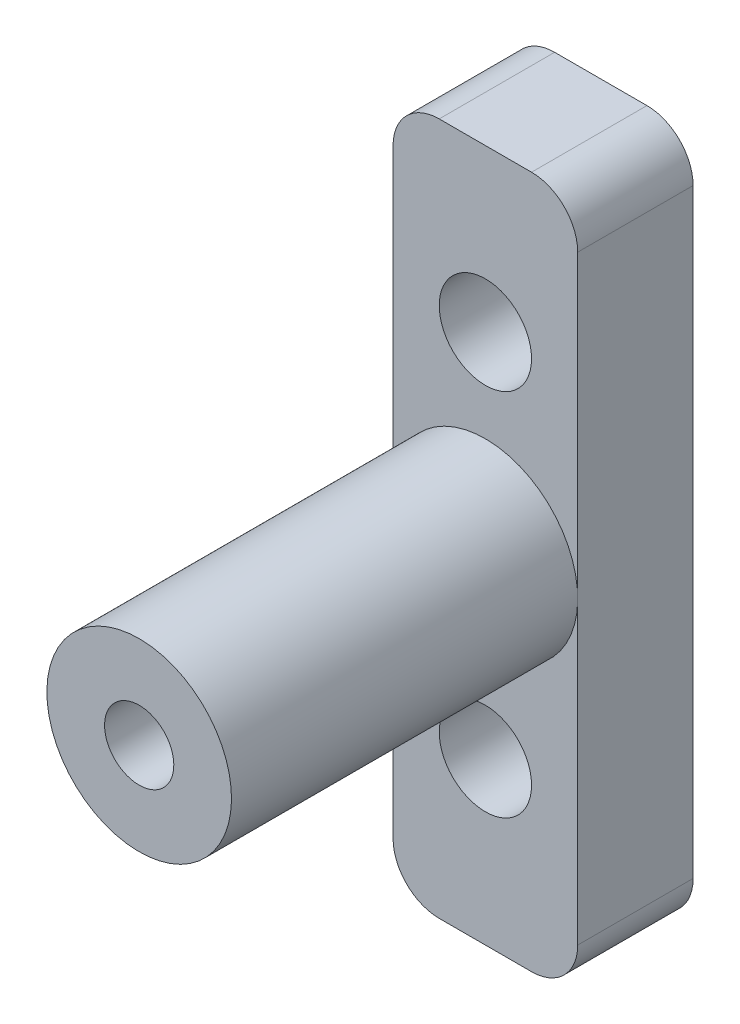
ISO-10303-21;
HEADER;
FILE_DESCRIPTION(('STEP AP214'),'2;1');
FILE_NAME('part.step','',(''),(''),'','','');
FILE_SCHEMA(('AUTOMOTIVE_DESIGN { 1 0 10303 214 1 1 1 1 }'));
ENDSEC;
DATA;
#1=APPLICATION_CONTEXT('core data for automotive mechanical design processes');
#2=APPLICATION_PROTOCOL_DEFINITION('international standard','automotive_design',2000,#1);
#3=PRODUCT_CONTEXT('',#1,'mechanical');
#4=PRODUCT('Part','Part','',(#3));
#5=PRODUCT_RELATED_PRODUCT_CATEGORY('part','',(#4));
#6=PRODUCT_DEFINITION_FORMATION('','',#4);
#7=PRODUCT_DEFINITION_CONTEXT('part definition',#1,'design');
#8=PRODUCT_DEFINITION('design','',#6,#7);
#9=PRODUCT_DEFINITION_SHAPE('','',#8);
#10=(LENGTH_UNIT() NAMED_UNIT(*) SI_UNIT(.MILLI.,.METRE.));
#11=(NAMED_UNIT(*) PLANE_ANGLE_UNIT() SI_UNIT($,.RADIAN.));
#12=(NAMED_UNIT(*) SI_UNIT($,.STERADIAN.) SOLID_ANGLE_UNIT());
#13=UNCERTAINTY_MEASURE_WITH_UNIT(LENGTH_MEASURE(1.E-05),#10,'distance_accuracy_value','');
#14=(GEOMETRIC_REPRESENTATION_CONTEXT(3) GLOBAL_UNCERTAINTY_ASSIGNED_CONTEXT((#13)) GLOBAL_UNIT_ASSIGNED_CONTEXT((#10,
#11,#12)) REPRESENTATION_CONTEXT('',''));
#15=CARTESIAN_POINT('',(0.,0.,0.));
#16=DIRECTION('',(0.,0.,1.));
#17=DIRECTION('',(1.,0.,0.));
#18=AXIS2_PLACEMENT_3D('',#15,#16,#17);
#19=CARTESIAN_POINT('',(4.,0.,5.));
#20=DIRECTION('',(0.,0.,1.));
#21=DIRECTION('',(-0.895267090854168,-0.44552983742227,0.));
#22=AXIS2_PLACEMENT_3D('',#19,#20,#21);
#23=CYLINDRICAL_SURFACE('',#22,4.);
#24=CARTESIAN_POINT('',(4.,0.,5.));
#25=DIRECTION('',(0.,0.,-1.));
#26=DIRECTION('',(0.895267090854168,0.44552983742227,0.));
#27=AXIS2_PLACEMENT_3D('',#24,#25,#26);
#28=CIRCLE('',#27,4.);
#29=CARTESIAN_POINT('',(7.58106836341667,1.78211934968908,5.));
#30=VERTEX_POINT('',#29);
#31=EDGE_CURVE('P0_E25',#30,#30,#28,.T.);
#32=ORIENTED_EDGE('',*,*,#31,.F.);
#33=EDGE_LOOP('',(#32));
#34=FACE_BOUND('',#33,.T.);
#35=CARTESIAN_POINT('',(4.,0.,20.));
#36=DIRECTION('',(0.,0.,-1.));
#37=DIRECTION('',(0.895267090854168,0.44552983742227,0.));
#38=AXIS2_PLACEMENT_3D('',#35,#36,#37);
#39=CIRCLE('',#38,4.);
#40=CARTESIAN_POINT('',(7.58106836341667,1.78211934968908,20.));
#41=VERTEX_POINT('',#40);
#42=EDGE_CURVE('P0_E20',#41,#41,#39,.T.);
#43=ORIENTED_EDGE('',*,*,#42,.T.);
#44=EDGE_LOOP('',(#43));
#45=FACE_BOUND('',#44,.T.);
#46=ADVANCED_FACE('P0_F17',(#34,#45),#23,.T.);
#47=CARTESIAN_POINT('',(4.,0.,5.));
#48=DIRECTION('',(0.,0.,-1.));
#49=DIRECTION('',(0.895267090854168,0.44552983742227,0.));
#50=AXIS2_PLACEMENT_3D('',#47,#48,#49);
#51=PLANE('',#50);
#52=CARTESIAN_POINT('',(4.,0.,5.));
#53=DIRECTION('',(0.,0.,-1.));
#54=DIRECTION('',(0.895267090854168,0.44552983742227,0.));
#55=AXIS2_PLACEMENT_3D('',#52,#53,#54);
#56=CIRCLE('',#55,2.);
#57=CARTESIAN_POINT('',(5.79053418170833,0.89105967484454,5.));
#58=VERTEX_POINT('',#57);
#59=EDGE_CURVE('P0_E10',#58,#58,#56,.T.);
#60=ORIENTED_EDGE('',*,*,#59,.F.);
#61=EDGE_LOOP('',(#60));
#62=FACE_BOUND('',#61,.T.);
#63=ORIENTED_EDGE('',*,*,#31,.T.);
#64=EDGE_LOOP('',(#63));
#65=FACE_BOUND('',#64,.T.);
#66=ADVANCED_FACE('P0_F54',(#62,#65),#51,.T.);
#67=CARTESIAN_POINT('',(4.,0.,20.));
#68=DIRECTION('',(0.,0.,-1.));
#69=DIRECTION('',(0.895267090854168,0.44552983742227,0.));
#70=AXIS2_PLACEMENT_3D('',#67,#68,#69);
#71=PLANE('',#70);
#72=CARTESIAN_POINT('',(4.,0.,20.));
#73=DIRECTION('',(0.,0.,1.));
#74=DIRECTION('',(-0.895267090854168,-0.44552983742227,0.));
#75=AXIS2_PLACEMENT_3D('',#72,#73,#74);
#76=CIRCLE('',#75,1.5);
#77=CARTESIAN_POINT('',(2.65709936371874,-0.668294756133405,20.));
#78=VERTEX_POINT('',#77);
#79=EDGE_CURVE('P0_E43',#78,#78,#76,.T.);
#80=ORIENTED_EDGE('',*,*,#79,.F.);
#81=EDGE_LOOP('',(#80));
#82=FACE_BOUND('',#81,.T.);
#83=ORIENTED_EDGE('',*,*,#42,.F.);
#84=EDGE_LOOP('',(#83));
#85=FACE_BOUND('',#84,.T.);
#86=ADVANCED_FACE('P0_F50',(#82,#85),#71,.F.);
#87=CARTESIAN_POINT('',(4.,0.,0.));
#88=DIRECTION('',(0.,0.,1.));
#89=DIRECTION('',(-0.895267090854168,-0.44552983742227,0.));
#90=AXIS2_PLACEMENT_3D('',#87,#88,#89);
#91=CYLINDRICAL_SURFACE('',#90,2.);
#92=CARTESIAN_POINT('',(4.,0.,0.));
#93=DIRECTION('',(0.,0.,-1.));
#94=DIRECTION('',(0.895267090854168,0.44552983742227,0.));
#95=AXIS2_PLACEMENT_3D('',#92,#93,#94);
#96=CIRCLE('',#95,2.);
#97=CARTESIAN_POINT('',(5.79053418170833,0.89105967484454,0.));
#98=VERTEX_POINT('',#97);
#99=EDGE_CURVE('P0_E32',#98,#98,#96,.T.);
#100=ORIENTED_EDGE('',*,*,#99,.F.);
#101=EDGE_LOOP('',(#100));
#102=FACE_BOUND('',#101,.T.);
#103=ORIENTED_EDGE('',*,*,#59,.T.);
#104=EDGE_LOOP('',(#103));
#105=FACE_BOUND('',#104,.T.);
#106=ADVANCED_FACE('P0_F53',(#102,#105),#91,.T.);
#107=CARTESIAN_POINT('',(4.,0.,0.));
#108=DIRECTION('',(0.,0.,-1.));
#109=DIRECTION('',(0.895267090854168,0.44552983742227,0.));
#110=AXIS2_PLACEMENT_3D('',#107,#108,#109);
#111=PLANE('',#110);
#112=ORIENTED_EDGE('',*,*,#99,.T.);
#113=EDGE_LOOP('',(#112));
#114=FACE_BOUND('',#113,.T.);
#115=ADVANCED_FACE('P0_F61',(#114),#111,.T.);
#116=CARTESIAN_POINT('',(4.,0.,10.));
#117=DIRECTION('',(0.,0.,1.));
#118=DIRECTION('',(-0.895267090854168,-0.44552983742227,0.));
#119=AXIS2_PLACEMENT_3D('',#116,#117,#118);
#120=CYLINDRICAL_SURFACE('',#119,1.5);
#121=CARTESIAN_POINT('',(4.,0.,10.));
#122=DIRECTION('',(0.,0.,1.));
#123=DIRECTION('',(-0.895267090854168,-0.44552983742227,0.));
#124=AXIS2_PLACEMENT_3D('',#121,#122,#123);
#125=CIRCLE('',#124,1.5);
#126=CARTESIAN_POINT('',(2.65709936371874,-0.668294756133405,10.));
#127=VERTEX_POINT('',#126);
#128=EDGE_CURVE('P0_E40',#127,#127,#125,.T.);
#129=ORIENTED_EDGE('',*,*,#128,.F.);
#130=EDGE_LOOP('',(#129));
#131=FACE_BOUND('',#130,.T.);
#132=ORIENTED_EDGE('',*,*,#79,.T.);
#133=EDGE_LOOP('',(#132));
#134=FACE_BOUND('',#133,.T.);
#135=ADVANCED_FACE('P0_F48',(#131,#134),#120,.F.);
#136=CARTESIAN_POINT('',(4.,0.,10.));
#137=DIRECTION('',(0.,0.,1.));
#138=DIRECTION('',(-0.895267090854168,-0.44552983742227,0.));
#139=AXIS2_PLACEMENT_3D('',#136,#137,#138);
#140=PLANE('',#139);
#141=ORIENTED_EDGE('',*,*,#128,.T.);
#142=EDGE_LOOP('',(#141));
#143=FACE_BOUND('',#142,.T.);
#144=ADVANCED_FACE('P0_F113',(#143),#140,.T.);
#145=CLOSED_SHELL('',(#46,#66,#86,#106,#115,#135,#144));
#146=MANIFOLD_SOLID_BREP('P0_B1',#145);
#147=CARTESIAN_POINT('',(5.99999999999999,13.,5.));
#148=DIRECTION('',(0.,0.,-1.));
#149=DIRECTION('',(-1.,0.,0.));
#150=AXIS2_PLACEMENT_3D('',#147,#148,#149);
#151=CYLINDRICAL_SURFACE('',#150,2.);
#152=CARTESIAN_POINT('',(5.99999999999999,13.,0.));
#153=DIRECTION('',(0.,0.,1.));
#154=DIRECTION('',(1.,0.,0.));
#155=AXIS2_PLACEMENT_3D('',#152,#153,#154);
#156=CIRCLE('',#155,2.);
#157=CARTESIAN_POINT('',(7.99999999999999,13.,0.));
#158=VERTEX_POINT('',#157);
#159=CARTESIAN_POINT('',(6.,15.,0.));
#160=VERTEX_POINT('',#159);
#161=EDGE_CURVE('P1_E167',#158,#160,#156,.T.);
#162=ORIENTED_EDGE('',*,*,#161,.T.);
#163=DIRECTION('',(0.,0.,-1.));
#164=VECTOR('',#163,1.);
#165=CARTESIAN_POINT('',(6.,15.,5.));
#166=LINE('',#165,#164);
#167=CARTESIAN_POINT('',(6.,15.,5.));
#168=VERTEX_POINT('',#167);
#169=EDGE_CURVE('P1_E12',#168,#160,#166,.T.);
#170=ORIENTED_EDGE('',*,*,#169,.F.);
#171=CARTESIAN_POINT('',(5.99999999999999,13.,5.));
#172=DIRECTION('',(0.,0.,1.));
#173=DIRECTION('',(1.,0.,0.));
#174=AXIS2_PLACEMENT_3D('',#171,#172,#173);
#175=CIRCLE('',#174,2.);
#176=CARTESIAN_POINT('',(7.99999999999999,13.,5.));
#177=VERTEX_POINT('',#176);
#178=EDGE_CURVE('P1_E133',#177,#168,#175,.T.);
#179=ORIENTED_EDGE('',*,*,#178,.F.);
#180=DIRECTION('',(0.,0.,-1.));
#181=VECTOR('',#180,1.);
#182=CARTESIAN_POINT('',(7.99999999999999,13.,5.));
#183=LINE('',#182,#181);
#184=EDGE_CURVE('P1_E113',#177,#158,#183,.T.);
#185=ORIENTED_EDGE('',*,*,#184,.T.);
#186=EDGE_LOOP('',(#162,#170,#179,#185));
#187=FACE_BOUND('',#186,.T.);
#188=ADVANCED_FACE('P1_F20',(#187),#151,.T.);
#189=CARTESIAN_POINT('',(2.,15.,5.));
#190=DIRECTION('',(0.,-1.,0.));
#191=DIRECTION('',(1.,0.,0.));
#192=AXIS2_PLACEMENT_3D('',#189,#190,#191);
#193=PLANE('',#192);
#194=DIRECTION('',(-1.,0.,0.));
#195=VECTOR('',#194,1.);
#196=CARTESIAN_POINT('',(2.,15.,0.));
#197=LINE('',#196,#195);
#198=CARTESIAN_POINT('',(2.,15.,0.));
#199=VERTEX_POINT('',#198);
#200=EDGE_CURVE('P1_E163',#160,#199,#197,.T.);
#201=ORIENTED_EDGE('',*,*,#200,.T.);
#202=DIRECTION('',(0.,0.,-1.));
#203=VECTOR('',#202,1.);
#204=CARTESIAN_POINT('',(2.,15.,5.));
#205=LINE('',#204,#203);
#206=CARTESIAN_POINT('',(2.,15.,5.));
#207=VERTEX_POINT('',#206);
#208=EDGE_CURVE('P1_E29',#207,#199,#205,.T.);
#209=ORIENTED_EDGE('',*,*,#208,.F.);
#210=DIRECTION('',(-1.,0.,0.));
#211=VECTOR('',#210,1.);
#212=CARTESIAN_POINT('',(2.,15.,5.));
#213=LINE('',#212,#211);
#214=EDGE_CURVE('P1_E80',#168,#207,#213,.T.);
#215=ORIENTED_EDGE('',*,*,#214,.F.);
#216=ORIENTED_EDGE('',*,*,#169,.T.);
#217=EDGE_LOOP('',(#201,#209,#215,#216));
#218=FACE_BOUND('',#217,.T.);
#219=ADVANCED_FACE('P1_F217',(#218),#193,.F.);
#220=CARTESIAN_POINT('',(2.,13.,5.));
#221=DIRECTION('',(0.,0.,-1.));
#222=DIRECTION('',(-1.,0.,0.));
#223=AXIS2_PLACEMENT_3D('',#220,#221,#222);
#224=CYLINDRICAL_SURFACE('',#223,2.);
#225=CARTESIAN_POINT('',(2.,13.,0.));
#226=DIRECTION('',(0.,0.,1.));
#227=DIRECTION('',(-1.,0.,0.));
#228=AXIS2_PLACEMENT_3D('',#225,#226,#227);
#229=CIRCLE('',#228,2.);
#230=CARTESIAN_POINT('',(0.,13.,0.));
#231=VERTEX_POINT('',#230);
#232=EDGE_CURVE('P1_E166',#199,#231,#229,.T.);
#233=ORIENTED_EDGE('',*,*,#232,.T.);
#234=DIRECTION('',(0.,0.,-1.));
#235=VECTOR('',#234,1.);
#236=CARTESIAN_POINT('',(0.,13.,5.));
#237=LINE('',#236,#235);
#238=CARTESIAN_POINT('',(0.,13.,5.));
#239=VERTEX_POINT('',#238);
#240=EDGE_CURVE('P1_E180',#239,#231,#237,.T.);
#241=ORIENTED_EDGE('',*,*,#240,.F.);
#242=CARTESIAN_POINT('',(2.,13.,5.));
#243=DIRECTION('',(0.,0.,1.));
#244=DIRECTION('',(-1.,0.,0.));
#245=AXIS2_PLACEMENT_3D('',#242,#243,#244);
#246=CIRCLE('',#245,2.);
#247=EDGE_CURVE('P1_E192',#207,#239,#246,.T.);
#248=ORIENTED_EDGE('',*,*,#247,.F.);
#249=ORIENTED_EDGE('',*,*,#208,.T.);
#250=EDGE_LOOP('',(#233,#241,#248,#249));
#251=FACE_BOUND('',#250,.T.);
#252=ADVANCED_FACE('P1_F190',(#251),#224,.T.);
#253=CARTESIAN_POINT('',(0.,-13.,5.));
#254=DIRECTION('',(1.,0.,0.));
#255=DIRECTION('',(0.,1.,0.));
#256=AXIS2_PLACEMENT_3D('',#253,#254,#255);
#257=PLANE('',#256);
#258=DIRECTION('',(0.,-1.,0.));
#259=VECTOR('',#258,1.);
#260=CARTESIAN_POINT('',(0.,-13.,0.));
#261=LINE('',#260,#259);
#262=CARTESIAN_POINT('',(0.,-13.,0.));
#263=VERTEX_POINT('',#262);
#264=EDGE_CURVE('P1_E171',#231,#263,#261,.T.);
#265=ORIENTED_EDGE('',*,*,#264,.T.);
#266=DIRECTION('',(0.,0.,-1.));
#267=VECTOR('',#266,1.);
#268=CARTESIAN_POINT('',(0.,-13.,5.));
#269=LINE('',#268,#267);
#270=CARTESIAN_POINT('',(0.,-13.,5.));
#271=VERTEX_POINT('',#270);
#272=EDGE_CURVE('P1_E183',#271,#263,#269,.T.);
#273=ORIENTED_EDGE('',*,*,#272,.F.);
#274=DIRECTION('',(0.,-1.,0.));
#275=VECTOR('',#274,1.);
#276=CARTESIAN_POINT('',(0.,-13.,5.));
#277=LINE('',#276,#275);
#278=EDGE_CURVE('P1_E210',#239,#271,#277,.T.);
#279=ORIENTED_EDGE('',*,*,#278,.F.);
#280=ORIENTED_EDGE('',*,*,#240,.T.);
#281=EDGE_LOOP('',(#265,#273,#279,#280));
#282=FACE_BOUND('',#281,.T.);
#283=ADVANCED_FACE('P1_F224',(#282),#257,.F.);
#284=CARTESIAN_POINT('',(2.,-13.,5.));
#285=DIRECTION('',(0.,0.,-1.));
#286=DIRECTION('',(-1.,0.,0.));
#287=AXIS2_PLACEMENT_3D('',#284,#285,#286);
#288=CYLINDRICAL_SURFACE('',#287,2.);
#289=CARTESIAN_POINT('',(2.,-13.,0.));
#290=DIRECTION('',(0.,0.,1.));
#291=DIRECTION('',(1.,0.,0.));
#292=AXIS2_PLACEMENT_3D('',#289,#290,#291);
#293=CIRCLE('',#292,2.);
#294=CARTESIAN_POINT('',(2.,-15.,0.));
#295=VERTEX_POINT('',#294);
#296=EDGE_CURVE('P1_E198',#263,#295,#293,.T.);
#297=ORIENTED_EDGE('',*,*,#296,.T.);
#298=DIRECTION('',(0.,0.,-1.));
#299=VECTOR('',#298,1.);
#300=CARTESIAN_POINT('',(2.,-15.,5.));
#301=LINE('',#300,#299);
#302=CARTESIAN_POINT('',(2.,-15.,5.));
#303=VERTEX_POINT('',#302);
#304=EDGE_CURVE('P1_E108',#303,#295,#301,.T.);
#305=ORIENTED_EDGE('',*,*,#304,.F.);
#306=CARTESIAN_POINT('',(2.,-13.,5.));
#307=DIRECTION('',(0.,0.,1.));
#308=DIRECTION('',(1.,0.,0.));
#309=AXIS2_PLACEMENT_3D('',#306,#307,#308);
#310=CIRCLE('',#309,2.);
#311=EDGE_CURVE('P1_E99',#271,#303,#310,.T.);
#312=ORIENTED_EDGE('',*,*,#311,.F.);
#313=ORIENTED_EDGE('',*,*,#272,.T.);
#314=EDGE_LOOP('',(#297,#305,#312,#313));
#315=FACE_BOUND('',#314,.T.);
#316=ADVANCED_FACE('P1_F229',(#315),#288,.T.);
#317=CARTESIAN_POINT('',(2.,-15.,5.));
#318=DIRECTION('',(0.,1.,0.));
#319=DIRECTION('',(-1.,0.,0.));
#320=AXIS2_PLACEMENT_3D('',#317,#318,#319);
#321=PLANE('',#320);
#322=DIRECTION('',(1.,0.,0.));
#323=VECTOR('',#322,1.);
#324=CARTESIAN_POINT('',(2.,-15.,0.));
#325=LINE('',#324,#323);
#326=CARTESIAN_POINT('',(6.,-15.,0.));
#327=VERTEX_POINT('',#326);
#328=EDGE_CURVE('P1_E107',#295,#327,#325,.T.);
#329=ORIENTED_EDGE('',*,*,#328,.T.);
#330=DIRECTION('',(0.,0.,-1.));
#331=VECTOR('',#330,1.);
#332=CARTESIAN_POINT('',(6.,-15.,5.));
#333=LINE('',#332,#331);
#334=CARTESIAN_POINT('',(6.,-15.,5.));
#335=VERTEX_POINT('',#334);
#336=EDGE_CURVE('P1_E104',#335,#327,#333,.T.);
#337=ORIENTED_EDGE('',*,*,#336,.F.);
#338=DIRECTION('',(1.,0.,0.));
#339=VECTOR('',#338,1.);
#340=CARTESIAN_POINT('',(2.,-15.,5.));
#341=LINE('',#340,#339);
#342=EDGE_CURVE('P1_E93',#303,#335,#341,.T.);
#343=ORIENTED_EDGE('',*,*,#342,.F.);
#344=ORIENTED_EDGE('',*,*,#304,.T.);
#345=EDGE_LOOP('',(#329,#337,#343,#344));
#346=FACE_BOUND('',#345,.T.);
#347=ADVANCED_FACE('P1_F105',(#346),#321,.F.);
#348=CARTESIAN_POINT('',(6.,-13.,5.));
#349=DIRECTION('',(0.,0.,-1.));
#350=DIRECTION('',(-1.,0.,0.));
#351=AXIS2_PLACEMENT_3D('',#348,#349,#350);
#352=CYLINDRICAL_SURFACE('',#351,2.);
#353=CARTESIAN_POINT('',(6.,-13.,0.));
#354=DIRECTION('',(0.,0.,1.));
#355=DIRECTION('',(-1.,0.,0.));
#356=AXIS2_PLACEMENT_3D('',#353,#354,#355);
#357=CIRCLE('',#356,2.);
#358=CARTESIAN_POINT('',(8.,-13.,0.));
#359=VERTEX_POINT('',#358);
#360=EDGE_CURVE('P1_E66',#327,#359,#357,.T.);
#361=ORIENTED_EDGE('',*,*,#360,.T.);
#362=DIRECTION('',(0.,0.,-1.));
#363=VECTOR('',#362,1.);
#364=CARTESIAN_POINT('',(8.,-13.,5.));
#365=LINE('',#364,#363);
#366=CARTESIAN_POINT('',(8.,-13.,5.));
#367=VERTEX_POINT('',#366);
#368=EDGE_CURVE('P1_E109',#367,#359,#365,.T.);
#369=ORIENTED_EDGE('',*,*,#368,.F.);
#370=CARTESIAN_POINT('',(6.,-13.,5.));
#371=DIRECTION('',(0.,0.,1.));
#372=DIRECTION('',(-1.,0.,0.));
#373=AXIS2_PLACEMENT_3D('',#370,#371,#372);
#374=CIRCLE('',#373,2.);
#375=EDGE_CURVE('P1_E97',#335,#367,#374,.T.);
#376=ORIENTED_EDGE('',*,*,#375,.F.);
#377=ORIENTED_EDGE('',*,*,#336,.T.);
#378=EDGE_LOOP('',(#361,#369,#376,#377));
#379=FACE_BOUND('',#378,.T.);
#380=ADVANCED_FACE('P1_F111',(#379),#352,.T.);
#381=CARTESIAN_POINT('',(8.,-13.,5.));
#382=DIRECTION('',(-1.,0.,0.));
#383=DIRECTION('',(0.,-1.,0.));
#384=AXIS2_PLACEMENT_3D('',#381,#382,#383);
#385=PLANE('',#384);
#386=DIRECTION('',(0.,1.,0.));
#387=VECTOR('',#386,1.);
#388=CARTESIAN_POINT('',(8.,-13.,0.));
#389=LINE('',#388,#387);
#390=EDGE_CURVE('P1_E72',#359,#158,#389,.T.);
#391=ORIENTED_EDGE('',*,*,#390,.T.);
#392=ORIENTED_EDGE('',*,*,#184,.F.);
#393=DIRECTION('',(0.,1.,0.));
#394=VECTOR('',#393,1.);
#395=CARTESIAN_POINT('',(8.,-13.,5.));
#396=LINE('',#395,#394);
#397=EDGE_CURVE('P1_E37',#367,#177,#396,.T.);
#398=ORIENTED_EDGE('',*,*,#397,.F.);
#399=ORIENTED_EDGE('',*,*,#368,.T.);
#400=EDGE_LOOP('',(#391,#392,#398,#399));
#401=FACE_BOUND('',#400,.T.);
#402=ADVANCED_FACE('P1_F236',(#401),#385,.F.);
#403=CARTESIAN_POINT('',(5.99999999999999,13.,5.));
#404=DIRECTION('',(0.,0.,1.));
#405=DIRECTION('',(1.,0.,0.));
#406=AXIS2_PLACEMENT_3D('',#403,#404,#405);
#407=PLANE('',#406);
#408=CARTESIAN_POINT('',(4.,-8.,5.));
#409=DIRECTION('',(0.,0.,1.));
#410=DIRECTION('',(1.,0.,0.));
#411=AXIS2_PLACEMENT_3D('',#408,#409,#410);
#412=CIRCLE('',#411,2.);
#413=CARTESIAN_POINT('',(6.,-8.,5.));
#414=VERTEX_POINT('',#413);
#415=EDGE_CURVE('P1_E266',#414,#414,#412,.T.);
#416=ORIENTED_EDGE('',*,*,#415,.F.);
#417=EDGE_LOOP('',(#416));
#418=FACE_BOUND('',#417,.T.);
#419=CARTESIAN_POINT('',(4.,8.,5.));
#420=DIRECTION('',(0.,0.,1.));
#421=DIRECTION('',(1.,0.,0.));
#422=AXIS2_PLACEMENT_3D('',#419,#420,#421);
#423=CIRCLE('',#422,2.);
#424=CARTESIAN_POINT('',(6.,8.,5.));
#425=VERTEX_POINT('',#424);
#426=EDGE_CURVE('P1_E130',#425,#425,#423,.T.);
#427=ORIENTED_EDGE('',*,*,#426,.F.);
#428=EDGE_LOOP('',(#427));
#429=FACE_BOUND('',#428,.T.);
#430=CARTESIAN_POINT('',(4.,0.,5.));
#431=DIRECTION('',(0.,0.,1.));
#432=DIRECTION('',(1.,0.,0.));
#433=AXIS2_PLACEMENT_3D('',#430,#431,#432);
#434=CIRCLE('',#433,2.);
#435=CARTESIAN_POINT('',(6.,0.,5.));
#436=VERTEX_POINT('',#435);
#437=EDGE_CURVE('P1_E124',#436,#436,#434,.T.);
#438=ORIENTED_EDGE('',*,*,#437,.F.);
#439=EDGE_LOOP('',(#438));
#440=FACE_BOUND('',#439,.T.);
#441=ORIENTED_EDGE('',*,*,#178,.T.);
#442=ORIENTED_EDGE('',*,*,#214,.T.);
#443=ORIENTED_EDGE('',*,*,#247,.T.);
#444=ORIENTED_EDGE('',*,*,#278,.T.);
#445=ORIENTED_EDGE('',*,*,#311,.T.);
#446=ORIENTED_EDGE('',*,*,#342,.T.);
#447=ORIENTED_EDGE('',*,*,#375,.T.);
#448=ORIENTED_EDGE('',*,*,#397,.T.);
#449=EDGE_LOOP('',(#441,#442,#443,#444,#445,#446,#447,#448));
#450=FACE_BOUND('',#449,.T.);
#451=ADVANCED_FACE('P1_F95',(#418,#429,#440,#450),#407,.T.);
#452=CARTESIAN_POINT('',(5.99999999999999,13.,0.));
#453=DIRECTION('',(0.,0.,1.));
#454=DIRECTION('',(1.,0.,0.));
#455=AXIS2_PLACEMENT_3D('',#452,#453,#454);
#456=PLANE('',#455);
#457=CARTESIAN_POINT('',(4.,-8.,0.));
#458=DIRECTION('',(0.,0.,1.));
#459=DIRECTION('',(1.,0.,0.));
#460=AXIS2_PLACEMENT_3D('',#457,#458,#459);
#461=CIRCLE('',#460,2.);
#462=CARTESIAN_POINT('',(6.,-8.,0.));
#463=VERTEX_POINT('',#462);
#464=EDGE_CURVE('P1_E276',#463,#463,#461,.T.);
#465=ORIENTED_EDGE('',*,*,#464,.T.);
#466=EDGE_LOOP('',(#465));
#467=FACE_BOUND('',#466,.T.);
#468=CARTESIAN_POINT('',(4.,8.,0.));
#469=DIRECTION('',(0.,0.,1.));
#470=DIRECTION('',(1.,0.,0.));
#471=AXIS2_PLACEMENT_3D('',#468,#469,#470);
#472=CIRCLE('',#471,2.);
#473=CARTESIAN_POINT('',(6.,8.,0.));
#474=VERTEX_POINT('',#473);
#475=EDGE_CURVE('P1_E261',#474,#474,#472,.T.);
#476=ORIENTED_EDGE('',*,*,#475,.T.);
#477=EDGE_LOOP('',(#476));
#478=FACE_BOUND('',#477,.T.);
#479=CARTESIAN_POINT('',(4.,0.,0.));
#480=DIRECTION('',(0.,0.,1.));
#481=DIRECTION('',(1.,0.,0.));
#482=AXIS2_PLACEMENT_3D('',#479,#480,#481);
#483=CIRCLE('',#482,2.);
#484=CARTESIAN_POINT('',(6.,0.,0.));
#485=VERTEX_POINT('',#484);
#486=EDGE_CURVE('P1_E129',#485,#485,#483,.T.);
#487=ORIENTED_EDGE('',*,*,#486,.T.);
#488=EDGE_LOOP('',(#487));
#489=FACE_BOUND('',#488,.T.);
#490=ORIENTED_EDGE('',*,*,#161,.F.);
#491=ORIENTED_EDGE('',*,*,#390,.F.);
#492=ORIENTED_EDGE('',*,*,#360,.F.);
#493=ORIENTED_EDGE('',*,*,#328,.F.);
#494=ORIENTED_EDGE('',*,*,#296,.F.);
#495=ORIENTED_EDGE('',*,*,#264,.F.);
#496=ORIENTED_EDGE('',*,*,#232,.F.);
#497=ORIENTED_EDGE('',*,*,#200,.F.);
#498=EDGE_LOOP('',(#490,#491,#492,#493,#494,#495,#496,#497));
#499=FACE_BOUND('',#498,.T.);
#500=ADVANCED_FACE('P1_F196',(#467,#478,#489,#499),#456,.F.);
#501=CARTESIAN_POINT('',(4.,0.,0.));
#502=DIRECTION('',(0.,0.,1.));
#503=DIRECTION('',(1.,0.,0.));
#504=AXIS2_PLACEMENT_3D('',#501,#502,#503);
#505=CYLINDRICAL_SURFACE('',#504,2.);
#506=ORIENTED_EDGE('',*,*,#486,.F.);
#507=EDGE_LOOP('',(#506));
#508=FACE_BOUND('',#507,.T.);
#509=ORIENTED_EDGE('',*,*,#437,.T.);
#510=EDGE_LOOP('',(#509));
#511=FACE_BOUND('',#510,.T.);
#512=ADVANCED_FACE('P1_F241',(#508,#511),#505,.F.);
#513=CARTESIAN_POINT('',(4.,8.,0.));
#514=DIRECTION('',(0.,0.,1.));
#515=DIRECTION('',(1.,0.,0.));
#516=AXIS2_PLACEMENT_3D('',#513,#514,#515);
#517=CYLINDRICAL_SURFACE('',#516,2.);
#518=ORIENTED_EDGE('',*,*,#475,.F.);
#519=EDGE_LOOP('',(#518));
#520=FACE_BOUND('',#519,.T.);
#521=ORIENTED_EDGE('',*,*,#426,.T.);
#522=EDGE_LOOP('',(#521));
#523=FACE_BOUND('',#522,.T.);
#524=ADVANCED_FACE('P1_F248',(#520,#523),#517,.F.);
#525=CARTESIAN_POINT('',(4.,-8.,0.));
#526=DIRECTION('',(0.,0.,1.));
#527=DIRECTION('',(1.,0.,0.));
#528=AXIS2_PLACEMENT_3D('',#525,#526,#527);
#529=CYLINDRICAL_SURFACE('',#528,2.);
#530=ORIENTED_EDGE('',*,*,#464,.F.);
#531=EDGE_LOOP('',(#530));
#532=FACE_BOUND('',#531,.T.);
#533=ORIENTED_EDGE('',*,*,#415,.T.);
#534=EDGE_LOOP('',(#533));
#535=FACE_BOUND('',#534,.T.);
#536=ADVANCED_FACE('P1_F250',(#532,#535),#529,.F.);
#537=CLOSED_SHELL('',(#188,#219,#252,#283,#316,#347,#380,#402,#451,#500,#512,#524,#536));
#538=MANIFOLD_SOLID_BREP('P1_B1',#537);
#539=ADVANCED_BREP_SHAPE_REPRESENTATION('',(#18,#146,#538),#14);
#540=SHAPE_DEFINITION_REPRESENTATION(#9,#539);
ENDSEC;
END-ISO-10303-21;
